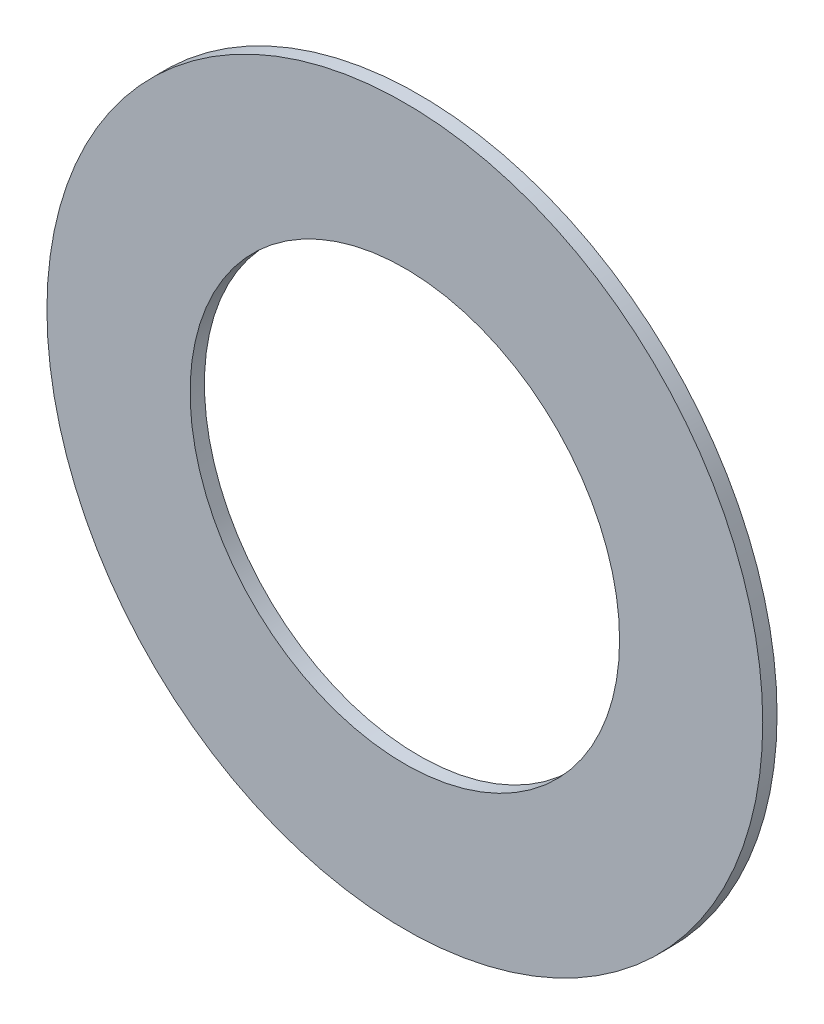
ISO-10303-21;
HEADER;
FILE_DESCRIPTION(('STEP AP214'),'2;1');
FILE_NAME('part.step','',(''),(''),'','','');
FILE_SCHEMA(('AUTOMOTIVE_DESIGN { 1 0 10303 214 1 1 1 1 }'));
ENDSEC;
DATA;
#1=APPLICATION_CONTEXT('core data for automotive mechanical design processes');
#2=APPLICATION_PROTOCOL_DEFINITION('international standard','automotive_design',2000,#1);
#3=PRODUCT_CONTEXT('',#1,'mechanical');
#4=PRODUCT('Part','Part','',(#3));
#5=PRODUCT_RELATED_PRODUCT_CATEGORY('part','',(#4));
#6=PRODUCT_DEFINITION_FORMATION('','',#4);
#7=PRODUCT_DEFINITION_CONTEXT('part definition',#1,'design');
#8=PRODUCT_DEFINITION('design','',#6,#7);
#9=PRODUCT_DEFINITION_SHAPE('','',#8);
#10=(LENGTH_UNIT() NAMED_UNIT(*) SI_UNIT(.MILLI.,.METRE.));
#11=(NAMED_UNIT(*) PLANE_ANGLE_UNIT() SI_UNIT($,.RADIAN.));
#12=(NAMED_UNIT(*) SI_UNIT($,.STERADIAN.) SOLID_ANGLE_UNIT());
#13=UNCERTAINTY_MEASURE_WITH_UNIT(LENGTH_MEASURE(1.E-05),#10,'distance_accuracy_value','');
#14=(GEOMETRIC_REPRESENTATION_CONTEXT(3) GLOBAL_UNCERTAINTY_ASSIGNED_CONTEXT((#13)) GLOBAL_UNIT_ASSIGNED_CONTEXT((#10,
#11,#12)) REPRESENTATION_CONTEXT('',''));
#15=CARTESIAN_POINT('',(0.,0.,0.));
#16=DIRECTION('',(0.,0.,1.));
#17=DIRECTION('',(1.,0.,0.));
#18=AXIS2_PLACEMENT_3D('',#15,#16,#17);
#19=CARTESIAN_POINT('',(0.,0.,0.05));
#20=DIRECTION('',(0.,0.,1.));
#21=DIRECTION('',(1.,0.,0.));
#22=AXIS2_PLACEMENT_3D('',#19,#20,#21);
#23=PLANE('',#22);
#24=CARTESIAN_POINT('',(0.,0.,0.05));
#25=DIRECTION('',(0.,0.,1.));
#26=DIRECTION('',(1.,0.,0.));
#27=AXIS2_PLACEMENT_3D('',#24,#25,#26);
#28=CIRCLE('',#27,2.5);
#29=CARTESIAN_POINT('',(2.5,0.,0.05));
#30=VERTEX_POINT('',#29);
#31=EDGE_CURVE('E10',#30,#30,#28,.T.);
#32=ORIENTED_EDGE('',*,*,#31,.T.);
#33=EDGE_LOOP('',(#32));
#34=FACE_BOUND('',#33,.T.);
#35=CARTESIAN_POINT('',(0.,0.,0.05));
#36=DIRECTION('',(0.,0.,1.));
#37=DIRECTION('',(1.,0.,0.));
#38=AXIS2_PLACEMENT_3D('',#35,#36,#37);
#39=CIRCLE('',#38,1.5);
#40=CARTESIAN_POINT('',(1.5,0.,0.05));
#41=VERTEX_POINT('',#40);
#42=EDGE_CURVE('E42',#41,#41,#39,.T.);
#43=ORIENTED_EDGE('',*,*,#42,.F.);
#44=EDGE_LOOP('',(#43));
#45=FACE_BOUND('',#44,.T.);
#46=ADVANCED_FACE('F31',(#34,#45),#23,.T.);
#47=CARTESIAN_POINT('',(0.,0.,-0.05));
#48=DIRECTION('',(0.,0.,1.));
#49=DIRECTION('',(1.,0.,0.));
#50=AXIS2_PLACEMENT_3D('',#47,#48,#49);
#51=PLANE('',#50);
#52=CARTESIAN_POINT('',(0.,0.,-0.05));
#53=DIRECTION('',(0.,0.,1.));
#54=DIRECTION('',(1.,0.,0.));
#55=AXIS2_PLACEMENT_3D('',#52,#53,#54);
#56=CIRCLE('',#55,2.5);
#57=CARTESIAN_POINT('',(2.5,0.,-0.05));
#58=VERTEX_POINT('',#57);
#59=EDGE_CURVE('E35',#58,#58,#56,.T.);
#60=ORIENTED_EDGE('',*,*,#59,.F.);
#61=EDGE_LOOP('',(#60));
#62=FACE_BOUND('',#61,.T.);
#63=CARTESIAN_POINT('',(0.,0.,-0.05));
#64=DIRECTION('',(0.,0.,1.));
#65=DIRECTION('',(1.,0.,0.));
#66=AXIS2_PLACEMENT_3D('',#63,#64,#65);
#67=CIRCLE('',#66,1.5);
#68=CARTESIAN_POINT('',(1.5,0.,-0.05));
#69=VERTEX_POINT('',#68);
#70=EDGE_CURVE('E44',#69,#69,#67,.T.);
#71=ORIENTED_EDGE('',*,*,#70,.T.);
#72=EDGE_LOOP('',(#71));
#73=FACE_BOUND('',#72,.T.);
#74=ADVANCED_FACE('F54',(#62,#73),#51,.F.);
#75=CARTESIAN_POINT('',(0.,0.,0.05));
#76=DIRECTION('',(0.,0.,-1.));
#77=DIRECTION('',(-1.,0.,0.));
#78=AXIS2_PLACEMENT_3D('',#75,#76,#77);
#79=CYLINDRICAL_SURFACE('',#78,2.5);
#80=ORIENTED_EDGE('',*,*,#31,.F.);
#81=EDGE_LOOP('',(#80));
#82=FACE_BOUND('',#81,.T.);
#83=ORIENTED_EDGE('',*,*,#59,.T.);
#84=EDGE_LOOP('',(#83));
#85=FACE_BOUND('',#84,.T.);
#86=ADVANCED_FACE('F33',(#82,#85),#79,.T.);
#87=CARTESIAN_POINT('',(0.,0.,0.05));
#88=DIRECTION('',(0.,0.,-1.));
#89=DIRECTION('',(-1.,0.,0.));
#90=AXIS2_PLACEMENT_3D('',#87,#88,#89);
#91=CYLINDRICAL_SURFACE('',#90,1.5);
#92=ORIENTED_EDGE('',*,*,#42,.T.);
#93=EDGE_LOOP('',(#92));
#94=FACE_BOUND('',#93,.T.);
#95=ORIENTED_EDGE('',*,*,#70,.F.);
#96=EDGE_LOOP('',(#95));
#97=FACE_BOUND('',#96,.T.);
#98=ADVANCED_FACE('F50',(#94,#97),#91,.F.);
#99=CLOSED_SHELL('',(#46,#74,#86,#98));
#100=MANIFOLD_SOLID_BREP('B2',#99);
#101=ADVANCED_BREP_SHAPE_REPRESENTATION('',(#18,#100),#14);
#102=SHAPE_DEFINITION_REPRESENTATION(#9,#101);
ENDSEC;
END-ISO-10303-21;
